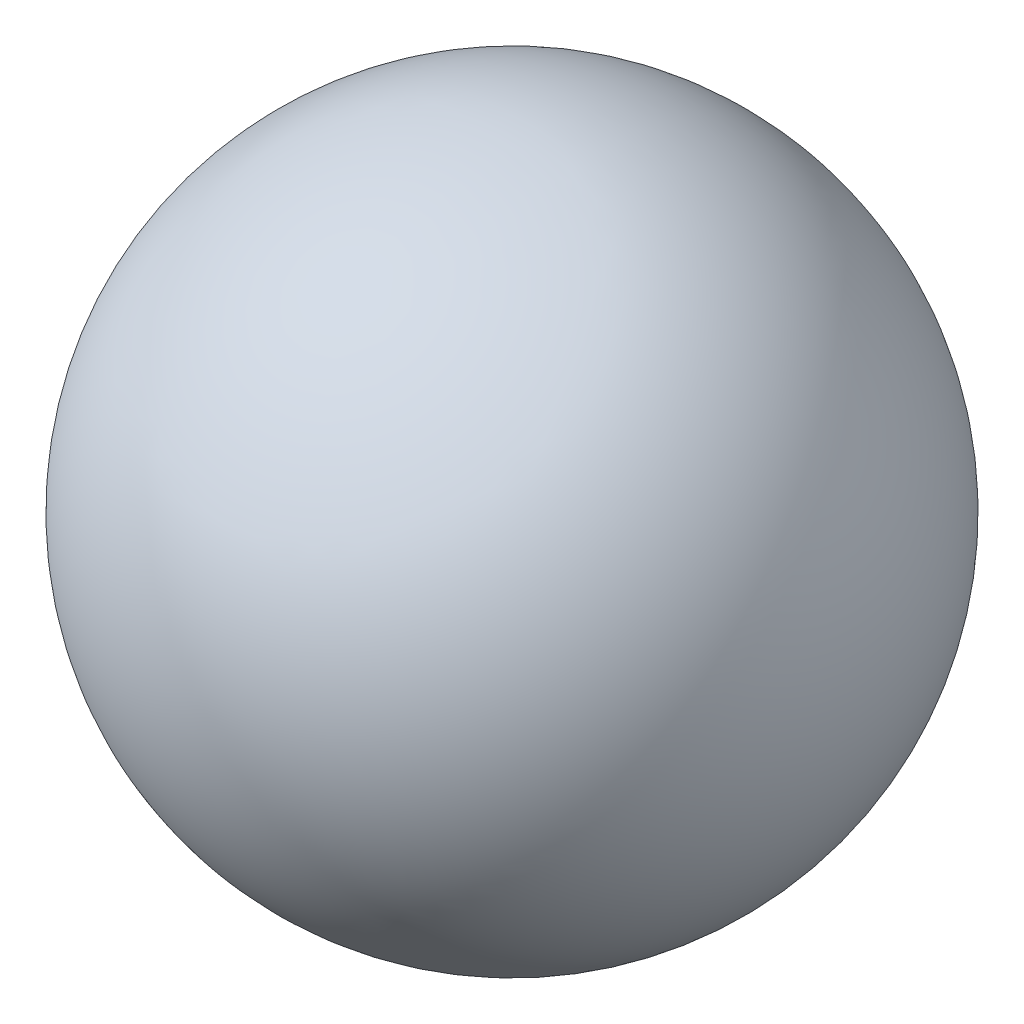
ISO-10303-21;
HEADER;
FILE_DESCRIPTION(('STEP AP214'),'2;1');
FILE_NAME('part.step','',(''),(''),'','','');
FILE_SCHEMA(('AUTOMOTIVE_DESIGN { 1 0 10303 214 1 1 1 1 }'));
ENDSEC;
DATA;
#1=APPLICATION_CONTEXT('core data for automotive mechanical design processes');
#2=APPLICATION_PROTOCOL_DEFINITION('international standard','automotive_design',2000,#1);
#3=PRODUCT_CONTEXT('',#1,'mechanical');
#4=PRODUCT('Part','Part','',(#3));
#5=PRODUCT_RELATED_PRODUCT_CATEGORY('part','',(#4));
#6=PRODUCT_DEFINITION_FORMATION('','',#4);
#7=PRODUCT_DEFINITION_CONTEXT('part definition',#1,'design');
#8=PRODUCT_DEFINITION('design','',#6,#7);
#9=PRODUCT_DEFINITION_SHAPE('','',#8);
#10=(LENGTH_UNIT() NAMED_UNIT(*) SI_UNIT(.MILLI.,.METRE.));
#11=(NAMED_UNIT(*) PLANE_ANGLE_UNIT() SI_UNIT($,.RADIAN.));
#12=(NAMED_UNIT(*) SI_UNIT($,.STERADIAN.) SOLID_ANGLE_UNIT());
#13=UNCERTAINTY_MEASURE_WITH_UNIT(LENGTH_MEASURE(1.E-05),#10,'distance_accuracy_value','');
#14=(GEOMETRIC_REPRESENTATION_CONTEXT(3) GLOBAL_UNCERTAINTY_ASSIGNED_CONTEXT((#13)) GLOBAL_UNIT_ASSIGNED_CONTEXT((#10,
#11,#12)) REPRESENTATION_CONTEXT('',''));
#15=CARTESIAN_POINT('',(0.,0.,0.));
#16=DIRECTION('',(0.,0.,1.));
#17=DIRECTION('',(1.,0.,0.));
#18=AXIS2_PLACEMENT_3D('',#15,#16,#17);
#19=CARTESIAN_POINT('',(64.16,19.3016172225726,-66.6441915067873));
#20=DIRECTION('',(0.,0.27818943001272,-0.9605262313072));
#21=DIRECTION('',(0.173648177666935,0.94593367956292,0.273963107482571));
#22=AXIS2_PLACEMENT_3D('',#19,#20,#21);
#23=SPHERICAL_SURFACE('',#22,7.15);
#24=CARTESIAN_POINT('',(64.16,21.2906716471636,-73.5119540606337));
#25=VERTEX_POINT('',#24);
#26=VERTEX_LOOP('',#25);
#27=FACE_BOUND('',#26,.T.);
#28=CARTESIAN_POINT('',(64.16,17.3125627979817,-59.7764289529409));
#29=VERTEX_POINT('',#28);
#30=VERTEX_LOOP('',#29);
#31=FACE_BOUND('',#30,.T.);
#32=ADVANCED_FACE('F15',(#27,#31),#23,.T.);
#33=CLOSED_SHELL('',(#32));
#34=MANIFOLD_SOLID_BREP('B1',#33);
#35=ADVANCED_BREP_SHAPE_REPRESENTATION('',(#18,#34),#14);
#36=SHAPE_DEFINITION_REPRESENTATION(#9,#35);
ENDSEC;
END-ISO-10303-21;
